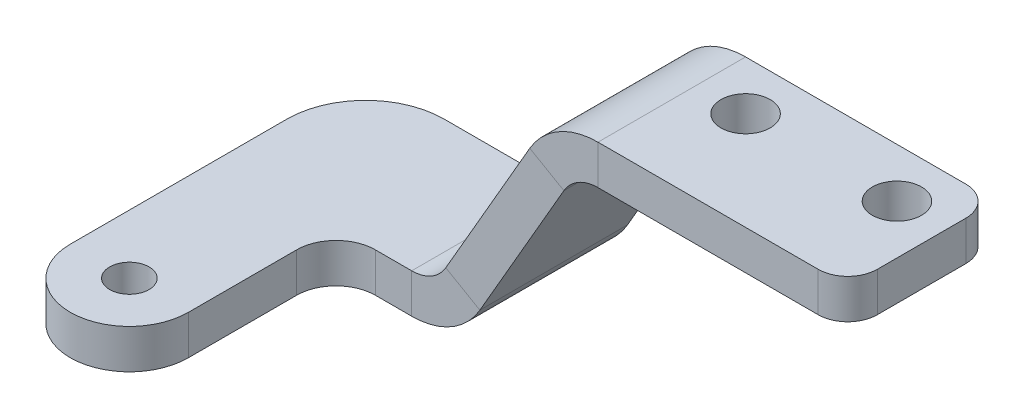
ISO-10303-21;
HEADER;
FILE_DESCRIPTION(('STEP AP214'),'2;1');
FILE_NAME('part.step','',(''),(''),'','','');
FILE_SCHEMA(('AUTOMOTIVE_DESIGN { 1 0 10303 214 1 1 1 1 }'));
ENDSEC;
DATA;
#1=APPLICATION_CONTEXT('core data for automotive mechanical design processes');
#2=APPLICATION_PROTOCOL_DEFINITION('international standard','automotive_design',2000,#1);
#3=PRODUCT_CONTEXT('',#1,'mechanical');
#4=PRODUCT('Part','Part','',(#3));
#5=PRODUCT_RELATED_PRODUCT_CATEGORY('part','',(#4));
#6=PRODUCT_DEFINITION_FORMATION('','',#4);
#7=PRODUCT_DEFINITION_CONTEXT('part definition',#1,'design');
#8=PRODUCT_DEFINITION('design','',#6,#7);
#9=PRODUCT_DEFINITION_SHAPE('','',#8);
#10=(LENGTH_UNIT() NAMED_UNIT(*) SI_UNIT(.MILLI.,.METRE.));
#11=(NAMED_UNIT(*) PLANE_ANGLE_UNIT() SI_UNIT($,.RADIAN.));
#12=(NAMED_UNIT(*) SI_UNIT($,.STERADIAN.) SOLID_ANGLE_UNIT());
#13=UNCERTAINTY_MEASURE_WITH_UNIT(LENGTH_MEASURE(1.E-05),#10,'distance_accuracy_value','');
#14=(GEOMETRIC_REPRESENTATION_CONTEXT(3) GLOBAL_UNCERTAINTY_ASSIGNED_CONTEXT((#13)) GLOBAL_UNIT_ASSIGNED_CONTEXT((#10,
#11,#12)) REPRESENTATION_CONTEXT('',''));
#15=CARTESIAN_POINT('',(0.,0.,0.));
#16=DIRECTION('',(0.,0.,1.));
#17=DIRECTION('',(1.,0.,0.));
#18=AXIS2_PLACEMENT_3D('',#15,#16,#17);
#19=CARTESIAN_POINT('',(30.3094010767586,16.7846096908265,-30.));
#20=DIRECTION('',(0.,0.,1.));
#21=DIRECTION('',(1.,0.,0.));
#22=AXIS2_PLACEMENT_3D('',#19,#20,#21);
#23=PLANE('',#22);
#24=DIRECTION('',(-0.866025403784436,0.500000000000004,0.));
#25=VECTOR('',#24,1.);
#26=CARTESIAN_POINT('',(29.1547005383793,14.7846096908265,-30.));
#27=LINE('',#26,#25);
#28=CARTESIAN_POINT('',(29.1547005383793,14.7846096908265,-30.));
#29=VERTEX_POINT('',#28);
#30=CARTESIAN_POINT('',(25.6905989232416,16.7846096908265,-30.));
#31=VERTEX_POINT('',#30);
#32=EDGE_CURVE('E218',#29,#31,#27,.T.);
#33=ORIENTED_EDGE('',*,*,#32,.F.);
#34=DIRECTION('',(0.500000000000004,0.866025403784437,0.));
#35=VECTOR('',#34,1.);
#36=CARTESIAN_POINT('',(30.3094010767586,16.7846096908265,-30.));
#37=LINE('',#36,#35);
#38=CARTESIAN_POINT('',(20.618802153517,0.,-30.));
#39=VERTEX_POINT('',#38);
#40=EDGE_CURVE('E234',#39,#29,#37,.T.);
#41=ORIENTED_EDGE('',*,*,#40,.F.);
#42=DIRECTION('',(0.866025403784436,-0.500000000000004,0.));
#43=VECTOR('',#42,1.);
#44=CARTESIAN_POINT('',(17.1547005383793,1.99999999999998,-30.));
#45=LINE('',#44,#43);
#46=CARTESIAN_POINT('',(17.1547005383793,1.99999999999999,-30.));
#47=VERTEX_POINT('',#46);
#48=EDGE_CURVE('E225',#47,#39,#45,.T.);
#49=ORIENTED_EDGE('',*,*,#48,.F.);
#50=DIRECTION('',(0.500000000000004,0.866025403784437,0.));
#51=VECTOR('',#50,1.);
#52=CARTESIAN_POINT('',(26.8452994616208,18.7846096908265,-30.));
#53=LINE('',#52,#51);
#54=EDGE_CURVE('E233',#47,#31,#53,.T.);
#55=ORIENTED_EDGE('',*,*,#54,.T.);
#56=EDGE_LOOP('',(#33,#41,#49,#55));
#57=FACE_BOUND('',#56,.T.);
#58=ADVANCED_FACE('F38',(#57),#23,.F.);
#59=CARTESIAN_POINT('',(19.4641016151377,-2.00000000000002,-15.));
#60=DIRECTION('',(0.,0.,-1.));
#61=DIRECTION('',(-1.,0.,0.));
#62=AXIS2_PLACEMENT_3D('',#59,#60,#61);
#63=PLANE('',#62);
#64=DIRECTION('',(-0.866025403784436,0.500000000000004,0.));
#65=VECTOR('',#64,1.);
#66=CARTESIAN_POINT('',(29.1547005383793,14.7846096908265,-15.));
#67=LINE('',#66,#65);
#68=CARTESIAN_POINT('',(29.1547005383793,14.7846096908265,-15.));
#69=VERTEX_POINT('',#68);
#70=CARTESIAN_POINT('',(25.6905989232416,16.7846096908265,-15.));
#71=VERTEX_POINT('',#70);
#72=EDGE_CURVE('E211',#69,#71,#67,.T.);
#73=ORIENTED_EDGE('',*,*,#72,.T.);
#74=DIRECTION('',(-0.500000000000004,-0.866025403784437,0.));
#75=VECTOR('',#74,1.);
#76=CARTESIAN_POINT('',(16.,0.,-15.));
#77=LINE('',#76,#75);
#78=CARTESIAN_POINT('',(17.1547005383792,1.99999999999999,-15.));
#79=VERTEX_POINT('',#78);
#80=EDGE_CURVE('E238',#71,#79,#77,.T.);
#81=ORIENTED_EDGE('',*,*,#80,.T.);
#82=DIRECTION('',(0.866025403784436,-0.500000000000004,0.));
#83=VECTOR('',#82,1.);
#84=CARTESIAN_POINT('',(17.1547005383793,1.99999999999998,-15.));
#85=LINE('',#84,#83);
#86=CARTESIAN_POINT('',(20.618802153517,0.,-15.));
#87=VERTEX_POINT('',#86);
#88=EDGE_CURVE('E221',#79,#87,#85,.T.);
#89=ORIENTED_EDGE('',*,*,#88,.T.);
#90=DIRECTION('',(-0.500000000000004,-0.866025403784437,0.));
#91=VECTOR('',#90,1.);
#92=CARTESIAN_POINT('',(19.4641016151377,-2.00000000000002,-15.));
#93=LINE('',#92,#91);
#94=EDGE_CURVE('E237',#69,#87,#93,.T.);
#95=ORIENTED_EDGE('',*,*,#94,.F.);
#96=EDGE_LOOP('',(#73,#81,#89,#95));
#97=FACE_BOUND('',#96,.T.);
#98=ADVANCED_FACE('F384',(#97),#63,.F.);
#99=CARTESIAN_POINT('',(15.4641016151377,-8.92820323027555,0.));
#100=DIRECTION('',(-0.866025403784437,0.500000000000004,0.));
#101=DIRECTION('',(-0.500000000000004,-0.866025403784437,0.));
#102=AXIS2_PLACEMENT_3D('',#99,#100,#101);
#103=PLANE('',#102);
#104=DIRECTION('',(0.,0.,1.));
#105=VECTOR('',#104,1.);
#106=CARTESIAN_POINT('',(29.1547005383793,14.7846096908265,-15.));
#107=LINE('',#106,#105);
#108=EDGE_CURVE('E215',#69,#29,#107,.F.);
#109=ORIENTED_EDGE('',*,*,#108,.F.);
#110=ORIENTED_EDGE('',*,*,#94,.T.);
#111=DIRECTION('',(0.,0.,1.));
#112=VECTOR('',#111,1.);
#113=CARTESIAN_POINT('',(20.618802153517,0.,0.));
#114=LINE('',#113,#112);
#115=EDGE_CURVE('E228',#39,#87,#114,.T.);
#116=ORIENTED_EDGE('',*,*,#115,.F.);
#117=ORIENTED_EDGE('',*,*,#40,.T.);
#118=EDGE_LOOP('',(#109,#110,#116,#117));
#119=FACE_BOUND('',#118,.T.);
#120=ADVANCED_FACE('F390',(#119),#103,.F.);
#121=CARTESIAN_POINT('',(11.9999999999999,-6.92820323027554,0.));
#122=DIRECTION('',(-0.866025403784437,0.500000000000004,0.));
#123=DIRECTION('',(-0.500000000000004,-0.866025403784437,0.));
#124=AXIS2_PLACEMENT_3D('',#121,#122,#123);
#125=PLANE('',#124);
#126=ORIENTED_EDGE('',*,*,#80,.F.);
#127=DIRECTION('',(0.,0.,1.));
#128=VECTOR('',#127,1.);
#129=CARTESIAN_POINT('',(25.6905989232416,16.7846096908265,-15.));
#130=LINE('',#129,#128);
#131=EDGE_CURVE('E183',#71,#31,#130,.F.);
#132=ORIENTED_EDGE('',*,*,#131,.T.);
#133=ORIENTED_EDGE('',*,*,#54,.F.);
#134=DIRECTION('',(0.,0.,-1.));
#135=VECTOR('',#134,1.);
#136=CARTESIAN_POINT('',(17.1547005383793,1.99999999999998,-15.));
#137=LINE('',#136,#135);
#138=EDGE_CURVE('E223',#79,#47,#137,.T.);
#139=ORIENTED_EDGE('',*,*,#138,.F.);
#140=EDGE_LOOP('',(#126,#132,#133,#139));
#141=FACE_BOUND('',#140,.T.);
#142=ADVANCED_FACE('F430',(#141),#125,.T.);
#143=CARTESIAN_POINT('',(2.,-4.,-30.));
#144=DIRECTION('',(0.,0.,-1.));
#145=DIRECTION('',(-1.,0.,0.));
#146=AXIS2_PLACEMENT_3D('',#143,#144,#145);
#147=PLANE('',#146);
#148=DIRECTION('',(-1.,0.,0.));
#149=VECTOR('',#148,1.);
#150=CARTESIAN_POINT('',(2.,0.,-30.));
#151=LINE('',#150,#149);
#152=CARTESIAN_POINT('',(13.6905989232415,0.,-30.));
#153=VERTEX_POINT('',#152);
#154=CARTESIAN_POINT('',(2.,0.,-30.));
#155=VERTEX_POINT('',#154);
#156=EDGE_CURVE('E277',#153,#155,#151,.T.);
#157=ORIENTED_EDGE('',*,*,#156,.F.);
#158=DIRECTION('',(0.,-1.,0.));
#159=VECTOR('',#158,1.);
#160=CARTESIAN_POINT('',(13.6905989232415,0.,-30.));
#161=LINE('',#160,#159);
#162=CARTESIAN_POINT('',(13.6905989232415,-4.,-30.));
#163=VERTEX_POINT('',#162);
#164=EDGE_CURVE('E250',#153,#163,#161,.T.);
#165=ORIENTED_EDGE('',*,*,#164,.T.);
#166=DIRECTION('',(-1.,0.,0.));
#167=VECTOR('',#166,1.);
#168=CARTESIAN_POINT('',(2.,-4.,-30.));
#169=LINE('',#168,#167);
#170=CARTESIAN_POINT('',(2.,-4.,-30.));
#171=VERTEX_POINT('',#170);
#172=EDGE_CURVE('E292',#163,#171,#169,.T.);
#173=ORIENTED_EDGE('',*,*,#172,.T.);
#174=DIRECTION('',(0.,1.,0.));
#175=VECTOR('',#174,1.);
#176=CARTESIAN_POINT('',(2.,-4.,-30.));
#177=LINE('',#176,#175);
#178=EDGE_CURVE('E313',#171,#155,#177,.T.);
#179=ORIENTED_EDGE('',*,*,#178,.T.);
#180=EDGE_LOOP('',(#157,#165,#173,#179));
#181=FACE_BOUND('',#180,.T.);
#182=ADVANCED_FACE('F422',(#181),#147,.T.);
#183=CARTESIAN_POINT('',(2.,-4.,-22.));
#184=DIRECTION('',(0.,1.,0.));
#185=DIRECTION('',(0.,0.,1.));
#186=AXIS2_PLACEMENT_3D('',#183,#184,#185);
#187=PLANE('',#186);
#188=CARTESIAN_POINT('',(0.,-4.,0.));
#189=DIRECTION('',(0.,1.,0.));
#190=DIRECTION('',(0.,0.,1.));
#191=AXIS2_PLACEMENT_3D('',#188,#189,#190);
#192=CIRCLE('',#191,2.);
#193=CARTESIAN_POINT('',(0.,-4.,2.));
#194=VERTEX_POINT('',#193);
#195=EDGE_CURVE('E267',#194,#194,#192,.T.);
#196=ORIENTED_EDGE('',*,*,#195,.T.);
#197=EDGE_LOOP('',(#196));
#198=FACE_BOUND('',#197,.T.);
#199=DIRECTION('',(0.,0.,-1.));
#200=VECTOR('',#199,1.);
#201=CARTESIAN_POINT('',(13.6905989232415,-4.,-30.));
#202=LINE('',#201,#200);
#203=CARTESIAN_POINT('',(13.6905989232415,-4.,-15.));
#204=VERTEX_POINT('',#203);
#205=EDGE_CURVE('E244',#163,#204,#202,.F.);
#206=ORIENTED_EDGE('',*,*,#205,.T.);
#207=DIRECTION('',(1.,0.,0.));
#208=VECTOR('',#207,1.);
#209=CARTESIAN_POINT('',(16.,-4.,-15.));
#210=LINE('',#209,#208);
#211=CARTESIAN_POINT('',(10.,-4.,-15.));
#212=VERTEX_POINT('',#211);
#213=EDGE_CURVE('E289',#212,#204,#210,.T.);
#214=ORIENTED_EDGE('',*,*,#213,.F.);
#215=CARTESIAN_POINT('',(10.,-4.,-11.));
#216=DIRECTION('',(0.,-1.,0.));
#217=DIRECTION('',(0.,0.,1.));
#218=AXIS2_PLACEMENT_3D('',#215,#216,#217);
#219=CIRCLE('',#218,4.);
#220=CARTESIAN_POINT('',(6.,-4.,-11.));
#221=VERTEX_POINT('',#220);
#222=EDGE_CURVE('E286',#221,#212,#219,.T.);
#223=ORIENTED_EDGE('',*,*,#222,.F.);
#224=DIRECTION('',(0.,0.,-1.));
#225=VECTOR('',#224,1.);
#226=CARTESIAN_POINT('',(6.,-4.,-11.));
#227=LINE('',#226,#225);
#228=CARTESIAN_POINT('',(6.,-4.,0.));
#229=VERTEX_POINT('',#228);
#230=EDGE_CURVE('E283',#229,#221,#227,.T.);
#231=ORIENTED_EDGE('',*,*,#230,.F.);
#232=CARTESIAN_POINT('',(0.,-4.,0.));
#233=DIRECTION('',(0.,1.,0.));
#234=DIRECTION('',(0.,0.,1.));
#235=AXIS2_PLACEMENT_3D('',#232,#233,#234);
#236=CIRCLE('',#235,6.);
#237=CARTESIAN_POINT('',(-6.,-4.,0.));
#238=VERTEX_POINT('',#237);
#239=EDGE_CURVE('E280',#238,#229,#236,.T.);
#240=ORIENTED_EDGE('',*,*,#239,.F.);
#241=DIRECTION('',(0.,0.,1.));
#242=VECTOR('',#241,1.);
#243=CARTESIAN_POINT('',(-6.,-4.,0.));
#244=LINE('',#243,#242);
#245=CARTESIAN_POINT('',(-6.,-4.,-22.));
#246=VERTEX_POINT('',#245);
#247=EDGE_CURVE('E276',#246,#238,#244,.T.);
#248=ORIENTED_EDGE('',*,*,#247,.F.);
#249=CARTESIAN_POINT('',(2.,-4.,-22.));
#250=DIRECTION('',(0.,1.,0.));
#251=DIRECTION('',(0.,0.,1.));
#252=AXIS2_PLACEMENT_3D('',#249,#250,#251);
#253=CIRCLE('',#252,8.);
#254=EDGE_CURVE('E273',#171,#246,#253,.T.);
#255=ORIENTED_EDGE('',*,*,#254,.F.);
#256=ORIENTED_EDGE('',*,*,#172,.F.);
#257=EDGE_LOOP('',(#206,#214,#223,#231,#240,#248,#255,#256));
#258=FACE_BOUND('',#257,.T.);
#259=ADVANCED_FACE('F418',(#198,#258),#187,.F.);
#260=CARTESIAN_POINT('',(2.,0.,-22.));
#261=DIRECTION('',(0.,1.,0.));
#262=DIRECTION('',(0.,0.,1.));
#263=AXIS2_PLACEMENT_3D('',#260,#261,#262);
#264=PLANE('',#263);
#265=CARTESIAN_POINT('',(0.,0.,0.));
#266=DIRECTION('',(0.,1.,0.));
#267=DIRECTION('',(0.,0.,1.));
#268=AXIS2_PLACEMENT_3D('',#265,#266,#267);
#269=CIRCLE('',#268,2.);
#270=CARTESIAN_POINT('',(0.,0.,2.));
#271=VERTEX_POINT('',#270);
#272=EDGE_CURVE('E264',#271,#271,#269,.T.);
#273=ORIENTED_EDGE('',*,*,#272,.F.);
#274=EDGE_LOOP('',(#273));
#275=FACE_BOUND('',#274,.T.);
#276=DIRECTION('',(1.,0.,0.));
#277=VECTOR('',#276,1.);
#278=CARTESIAN_POINT('',(16.,0.,-15.));
#279=LINE('',#278,#277);
#280=CARTESIAN_POINT('',(10.,0.,-15.));
#281=VERTEX_POINT('',#280);
#282=CARTESIAN_POINT('',(13.6905989232415,0.,-15.));
#283=VERTEX_POINT('',#282);
#284=EDGE_CURVE('E309',#281,#283,#279,.T.);
#285=ORIENTED_EDGE('',*,*,#284,.T.);
#286=DIRECTION('',(0.,0.,-1.));
#287=VECTOR('',#286,1.);
#288=CARTESIAN_POINT('',(13.6905989232415,0.,-30.));
#289=LINE('',#288,#287);
#290=EDGE_CURVE('E256',#153,#283,#289,.F.);
#291=ORIENTED_EDGE('',*,*,#290,.F.);
#292=ORIENTED_EDGE('',*,*,#156,.T.);
#293=CARTESIAN_POINT('',(2.,0.,-22.));
#294=DIRECTION('',(0.,1.,0.));
#295=DIRECTION('',(0.,0.,1.));
#296=AXIS2_PLACEMENT_3D('',#293,#294,#295);
#297=CIRCLE('',#296,8.);
#298=CARTESIAN_POINT('',(-6.,0.,-22.));
#299=VERTEX_POINT('',#298);
#300=EDGE_CURVE('E270',#155,#299,#297,.T.);
#301=ORIENTED_EDGE('',*,*,#300,.T.);
#302=DIRECTION('',(0.,0.,1.));
#303=VECTOR('',#302,1.);
#304=CARTESIAN_POINT('',(-6.,0.,0.));
#305=LINE('',#304,#303);
#306=CARTESIAN_POINT('',(-6.,0.,0.));
#307=VERTEX_POINT('',#306);
#308=EDGE_CURVE('E297',#299,#307,#305,.T.);
#309=ORIENTED_EDGE('',*,*,#308,.T.);
#310=CARTESIAN_POINT('',(0.,0.,0.));
#311=DIRECTION('',(0.,1.,0.));
#312=DIRECTION('',(0.,0.,1.));
#313=AXIS2_PLACEMENT_3D('',#310,#311,#312);
#314=CIRCLE('',#313,6.);
#315=CARTESIAN_POINT('',(6.,0.,0.));
#316=VERTEX_POINT('',#315);
#317=EDGE_CURVE('E300',#307,#316,#314,.T.);
#318=ORIENTED_EDGE('',*,*,#317,.T.);
#319=DIRECTION('',(0.,0.,-1.));
#320=VECTOR('',#319,1.);
#321=CARTESIAN_POINT('',(6.,0.,-11.));
#322=LINE('',#321,#320);
#323=CARTESIAN_POINT('',(6.,0.,-11.));
#324=VERTEX_POINT('',#323);
#325=EDGE_CURVE('E303',#316,#324,#322,.T.);
#326=ORIENTED_EDGE('',*,*,#325,.T.);
#327=CARTESIAN_POINT('',(10.,0.,-11.));
#328=DIRECTION('',(0.,-1.,0.));
#329=DIRECTION('',(0.,0.,1.));
#330=AXIS2_PLACEMENT_3D('',#327,#328,#329);
#331=CIRCLE('',#330,4.);
#332=EDGE_CURVE('E306',#324,#281,#331,.T.);
#333=ORIENTED_EDGE('',*,*,#332,.T.);
#334=EDGE_LOOP('',(#285,#291,#292,#301,#309,#318,#326,#333));
#335=FACE_BOUND('',#334,.T.);
#336=ADVANCED_FACE('F421',(#275,#335),#264,.T.);
#337=CARTESIAN_POINT('',(2.,-4.,-22.));
#338=DIRECTION('',(0.,1.,0.));
#339=DIRECTION('',(0.,0.,1.));
#340=AXIS2_PLACEMENT_3D('',#337,#338,#339);
#341=CYLINDRICAL_SURFACE('',#340,8.);
#342=ORIENTED_EDGE('',*,*,#300,.F.);
#343=ORIENTED_EDGE('',*,*,#178,.F.);
#344=ORIENTED_EDGE('',*,*,#254,.T.);
#345=DIRECTION('',(0.,1.,0.));
#346=VECTOR('',#345,1.);
#347=CARTESIAN_POINT('',(-6.,-4.,-22.));
#348=LINE('',#347,#346);
#349=EDGE_CURVE('E294',#246,#299,#348,.T.);
#350=ORIENTED_EDGE('',*,*,#349,.T.);
#351=EDGE_LOOP('',(#342,#343,#344,#350));
#352=FACE_BOUND('',#351,.T.);
#353=ADVANCED_FACE('F426',(#352),#341,.T.);
#354=CARTESIAN_POINT('',(16.,-4.,-15.));
#355=DIRECTION('',(0.,0.,1.));
#356=DIRECTION('',(1.,0.,0.));
#357=AXIS2_PLACEMENT_3D('',#354,#355,#356);
#358=PLANE('',#357);
#359=DIRECTION('',(0.,-1.,0.));
#360=VECTOR('',#359,1.);
#361=CARTESIAN_POINT('',(13.6905989232415,0.,-15.));
#362=LINE('',#361,#360);
#363=EDGE_CURVE('E261',#283,#204,#362,.T.);
#364=ORIENTED_EDGE('',*,*,#363,.F.);
#365=ORIENTED_EDGE('',*,*,#284,.F.);
#366=DIRECTION('',(0.,1.,0.));
#367=VECTOR('',#366,1.);
#368=CARTESIAN_POINT('',(10.,-4.,-15.));
#369=LINE('',#368,#367);
#370=EDGE_CURVE('E317',#212,#281,#369,.T.);
#371=ORIENTED_EDGE('',*,*,#370,.F.);
#372=ORIENTED_EDGE('',*,*,#213,.T.);
#373=EDGE_LOOP('',(#364,#365,#371,#372));
#374=FACE_BOUND('',#373,.T.);
#375=ADVANCED_FACE('F432',(#374),#358,.T.);
#376=CARTESIAN_POINT('',(10.,-4.,-11.));
#377=DIRECTION('',(0.,1.,0.));
#378=DIRECTION('',(0.,0.,1.));
#379=AXIS2_PLACEMENT_3D('',#376,#377,#378);
#380=CYLINDRICAL_SURFACE('',#379,4.);
#381=ORIENTED_EDGE('',*,*,#332,.F.);
#382=DIRECTION('',(0.,1.,0.));
#383=VECTOR('',#382,1.);
#384=CARTESIAN_POINT('',(6.,-4.,-11.));
#385=LINE('',#384,#383);
#386=EDGE_CURVE('E319',#221,#324,#385,.T.);
#387=ORIENTED_EDGE('',*,*,#386,.F.);
#388=ORIENTED_EDGE('',*,*,#222,.T.);
#389=ORIENTED_EDGE('',*,*,#370,.T.);
#390=EDGE_LOOP('',(#381,#387,#388,#389));
#391=FACE_BOUND('',#390,.T.);
#392=ADVANCED_FACE('F435',(#391),#380,.F.);
#393=CARTESIAN_POINT('',(6.,-4.,-11.));
#394=DIRECTION('',(1.,0.,0.));
#395=DIRECTION('',(0.,0.,-1.));
#396=AXIS2_PLACEMENT_3D('',#393,#394,#395);
#397=PLANE('',#396);
#398=ORIENTED_EDGE('',*,*,#325,.F.);
#399=DIRECTION('',(0.,1.,0.));
#400=VECTOR('',#399,1.);
#401=CARTESIAN_POINT('',(6.,-4.,0.));
#402=LINE('',#401,#400);
#403=EDGE_CURVE('E321',#229,#316,#402,.T.);
#404=ORIENTED_EDGE('',*,*,#403,.F.);
#405=ORIENTED_EDGE('',*,*,#230,.T.);
#406=ORIENTED_EDGE('',*,*,#386,.T.);
#407=EDGE_LOOP('',(#398,#404,#405,#406));
#408=FACE_BOUND('',#407,.T.);
#409=ADVANCED_FACE('F439',(#408),#397,.T.);
#410=CARTESIAN_POINT('',(0.,-4.,0.));
#411=DIRECTION('',(0.,1.,0.));
#412=DIRECTION('',(0.,0.,1.));
#413=AXIS2_PLACEMENT_3D('',#410,#411,#412);
#414=CYLINDRICAL_SURFACE('',#413,6.);
#415=ORIENTED_EDGE('',*,*,#317,.F.);
#416=DIRECTION('',(0.,1.,0.));
#417=VECTOR('',#416,1.);
#418=CARTESIAN_POINT('',(-6.,-4.,0.));
#419=LINE('',#418,#417);
#420=EDGE_CURVE('E323',#238,#307,#419,.T.);
#421=ORIENTED_EDGE('',*,*,#420,.F.);
#422=ORIENTED_EDGE('',*,*,#239,.T.);
#423=ORIENTED_EDGE('',*,*,#403,.T.);
#424=EDGE_LOOP('',(#415,#421,#422,#423));
#425=FACE_BOUND('',#424,.T.);
#426=ADVANCED_FACE('F443',(#425),#414,.T.);
#427=CARTESIAN_POINT('',(-6.,-4.,0.));
#428=DIRECTION('',(-1.,0.,0.));
#429=DIRECTION('',(0.,0.,1.));
#430=AXIS2_PLACEMENT_3D('',#427,#428,#429);
#431=PLANE('',#430);
#432=ORIENTED_EDGE('',*,*,#308,.F.);
#433=ORIENTED_EDGE('',*,*,#349,.F.);
#434=ORIENTED_EDGE('',*,*,#247,.T.);
#435=ORIENTED_EDGE('',*,*,#420,.T.);
#436=EDGE_LOOP('',(#432,#433,#434,#435));
#437=FACE_BOUND('',#436,.T.);
#438=ADVANCED_FACE('F416',(#437),#431,.T.);
#439=CARTESIAN_POINT('',(0.,-4.,0.));
#440=DIRECTION('',(0.,1.,0.));
#441=DIRECTION('',(0.,0.,1.));
#442=AXIS2_PLACEMENT_3D('',#439,#440,#441);
#443=CYLINDRICAL_SURFACE('',#442,2.);
#444=ORIENTED_EDGE('',*,*,#195,.F.);
#445=EDGE_LOOP('',(#444));
#446=FACE_BOUND('',#445,.T.);
#447=ORIENTED_EDGE('',*,*,#272,.T.);
#448=EDGE_LOOP('',(#447));
#449=FACE_BOUND('',#448,.T.);
#450=ADVANCED_FACE('F409',(#446,#449),#443,.F.);
#451=CARTESIAN_POINT('',(13.6905989232415,4.,-15.));
#452=DIRECTION('',(0.,0.,1.));
#453=DIRECTION('',(1.,0.,0.));
#454=AXIS2_PLACEMENT_3D('',#451,#452,#453);
#455=PLANE('',#454);
#456=ORIENTED_EDGE('',*,*,#88,.F.);
#457=CARTESIAN_POINT('',(13.6905989232415,4.,-15.));
#458=DIRECTION('',(0.,0.,-1.));
#459=DIRECTION('',(-1.,0.,0.));
#460=AXIS2_PLACEMENT_3D('',#457,#458,#459);
#461=CIRCLE('',#460,4.);
#462=EDGE_CURVE('E253',#283,#79,#461,.F.);
#463=ORIENTED_EDGE('',*,*,#462,.F.);
#464=ORIENTED_EDGE('',*,*,#363,.T.);
#465=CARTESIAN_POINT('',(13.6905989232415,4.,-15.));
#466=DIRECTION('',(0.,0.,-1.));
#467=DIRECTION('',(-1.,0.,0.));
#468=AXIS2_PLACEMENT_3D('',#465,#466,#467);
#469=CIRCLE('',#468,8.);
#470=EDGE_CURVE('E246',#204,#87,#469,.F.);
#471=ORIENTED_EDGE('',*,*,#470,.T.);
#472=EDGE_LOOP('',(#456,#463,#464,#471));
#473=FACE_BOUND('',#472,.T.);
#474=ADVANCED_FACE('F406',(#473),#455,.T.);
#475=CARTESIAN_POINT('',(13.6905989232415,4.,-30.));
#476=DIRECTION('',(0.,0.,1.));
#477=DIRECTION('',(1.,0.,0.));
#478=AXIS2_PLACEMENT_3D('',#475,#476,#477);
#479=PLANE('',#478);
#480=CARTESIAN_POINT('',(13.6905989232415,4.,-30.));
#481=DIRECTION('',(0.,0.,-1.));
#482=DIRECTION('',(-1.,0.,0.));
#483=AXIS2_PLACEMENT_3D('',#480,#481,#482);
#484=CIRCLE('',#483,4.);
#485=EDGE_CURVE('E240',#47,#153,#484,.T.);
#486=ORIENTED_EDGE('',*,*,#485,.F.);
#487=ORIENTED_EDGE('',*,*,#48,.T.);
#488=CARTESIAN_POINT('',(13.6905989232415,4.,-30.));
#489=DIRECTION('',(0.,0.,-1.));
#490=DIRECTION('',(-1.,0.,0.));
#491=AXIS2_PLACEMENT_3D('',#488,#489,#490);
#492=CIRCLE('',#491,8.);
#493=EDGE_CURVE('E247',#39,#163,#492,.T.);
#494=ORIENTED_EDGE('',*,*,#493,.T.);
#495=ORIENTED_EDGE('',*,*,#164,.F.);
#496=EDGE_LOOP('',(#486,#487,#494,#495));
#497=FACE_BOUND('',#496,.T.);
#498=ADVANCED_FACE('F400',(#497),#479,.F.);
#499=CARTESIAN_POINT('',(13.6905989232415,4.,-30.));
#500=DIRECTION('',(0.,0.,-1.));
#501=DIRECTION('',(0.866025403784437,-0.500000000000004,0.));
#502=AXIS2_PLACEMENT_3D('',#499,#500,#501);
#503=CYLINDRICAL_SURFACE('',#502,8.);
#504=ORIENTED_EDGE('',*,*,#205,.F.);
#505=ORIENTED_EDGE('',*,*,#493,.F.);
#506=ORIENTED_EDGE('',*,*,#115,.T.);
#507=ORIENTED_EDGE('',*,*,#470,.F.);
#508=EDGE_LOOP('',(#504,#505,#506,#507));
#509=FACE_BOUND('',#508,.T.);
#510=ADVANCED_FACE('F396',(#509),#503,.T.);
#511=CARTESIAN_POINT('',(13.6905989232415,4.,-30.));
#512=DIRECTION('',(0.,0.,-1.));
#513=DIRECTION('',(0.866025403784437,-0.500000000000004,0.));
#514=AXIS2_PLACEMENT_3D('',#511,#512,#513);
#515=CYLINDRICAL_SURFACE('',#514,4.);
#516=ORIENTED_EDGE('',*,*,#290,.T.);
#517=ORIENTED_EDGE('',*,*,#462,.T.);
#518=ORIENTED_EDGE('',*,*,#138,.T.);
#519=ORIENTED_EDGE('',*,*,#485,.T.);
#520=EDGE_LOOP('',(#516,#517,#518,#519));
#521=FACE_BOUND('',#520,.T.);
#522=ADVANCED_FACE('F399',(#521),#515,.F.);
#523=CARTESIAN_POINT('',(32.6188021535171,12.7846096908265,-30.));
#524=DIRECTION('',(0.,0.,-1.));
#525=DIRECTION('',(-1.,0.,0.));
#526=AXIS2_PLACEMENT_3D('',#523,#524,#525);
#527=PLANE('',#526);
#528=DIRECTION('',(0.,1.,0.));
#529=VECTOR('',#528,1.);
#530=CARTESIAN_POINT('',(32.6188021535171,16.7846096908265,-30.));
#531=LINE('',#530,#529);
#532=CARTESIAN_POINT('',(32.6188021535171,16.7846096908265,-30.));
#533=VERTEX_POINT('',#532);
#534=CARTESIAN_POINT('',(32.6188021535171,20.7846096908265,-30.));
#535=VERTEX_POINT('',#534);
#536=EDGE_CURVE('E203',#533,#535,#531,.T.);
#537=ORIENTED_EDGE('',*,*,#536,.F.);
#538=CARTESIAN_POINT('',(32.6188021535171,12.7846096908265,-30.));
#539=DIRECTION('',(0.,0.,1.));
#540=DIRECTION('',(1.,0.,0.));
#541=AXIS2_PLACEMENT_3D('',#538,#539,#540);
#542=CIRCLE('',#541,4.00000000000001);
#543=EDGE_CURVE('E186',#29,#533,#542,.F.);
#544=ORIENTED_EDGE('',*,*,#543,.F.);
#545=ORIENTED_EDGE('',*,*,#32,.T.);
#546=CARTESIAN_POINT('',(32.6188021535171,12.7846096908265,-30.));
#547=DIRECTION('',(0.,0.,1.));
#548=DIRECTION('',(1.,0.,0.));
#549=AXIS2_PLACEMENT_3D('',#546,#547,#548);
#550=CIRCLE('',#549,8.00000000000001);
#551=EDGE_CURVE('E210',#31,#535,#550,.F.);
#552=ORIENTED_EDGE('',*,*,#551,.T.);
#553=EDGE_LOOP('',(#537,#544,#545,#552));
#554=FACE_BOUND('',#553,.T.);
#555=ADVANCED_FACE('F404',(#554),#527,.T.);
#556=CARTESIAN_POINT('',(32.6188021535171,12.7846096908265,-15.));
#557=DIRECTION('',(0.,0.,-1.));
#558=DIRECTION('',(-1.,0.,0.));
#559=AXIS2_PLACEMENT_3D('',#556,#557,#558);
#560=PLANE('',#559);
#561=CARTESIAN_POINT('',(32.6188021535171,12.7846096908265,-15.));
#562=DIRECTION('',(0.,0.,1.));
#563=DIRECTION('',(1.,0.,0.));
#564=AXIS2_PLACEMENT_3D('',#561,#562,#563);
#565=CIRCLE('',#564,4.00000000000001);
#566=CARTESIAN_POINT('',(32.6188021535171,16.7846096908265,-15.));
#567=VERTEX_POINT('',#566);
#568=EDGE_CURVE('E173',#567,#69,#565,.T.);
#569=ORIENTED_EDGE('',*,*,#568,.F.);
#570=DIRECTION('',(0.,1.,0.));
#571=VECTOR('',#570,1.);
#572=CARTESIAN_POINT('',(32.6188021535171,16.7846096908265,-15.));
#573=LINE('',#572,#571);
#574=CARTESIAN_POINT('',(32.6188021535171,20.7846096908265,-15.));
#575=VERTEX_POINT('',#574);
#576=EDGE_CURVE('E166',#567,#575,#573,.T.);
#577=ORIENTED_EDGE('',*,*,#576,.T.);
#578=CARTESIAN_POINT('',(32.6188021535171,12.7846096908265,-15.));
#579=DIRECTION('',(0.,0.,1.));
#580=DIRECTION('',(1.,0.,0.));
#581=AXIS2_PLACEMENT_3D('',#578,#579,#580);
#582=CIRCLE('',#581,8.00000000000001);
#583=EDGE_CURVE('E178',#575,#71,#582,.T.);
#584=ORIENTED_EDGE('',*,*,#583,.T.);
#585=ORIENTED_EDGE('',*,*,#72,.F.);
#586=EDGE_LOOP('',(#569,#577,#584,#585));
#587=FACE_BOUND('',#586,.T.);
#588=ADVANCED_FACE('F189',(#587),#560,.F.);
#589=CARTESIAN_POINT('',(32.6188021535171,12.7846096908265,-15.));
#590=DIRECTION('',(0.,0.,1.));
#591=DIRECTION('',(0.,1.,0.));
#592=AXIS2_PLACEMENT_3D('',#589,#590,#591);
#593=CYLINDRICAL_SURFACE('',#592,8.00000000000001);
#594=ORIENTED_EDGE('',*,*,#131,.F.);
#595=ORIENTED_EDGE('',*,*,#583,.F.);
#596=DIRECTION('',(0.,0.,1.));
#597=VECTOR('',#596,1.);
#598=CARTESIAN_POINT('',(32.6188021535171,20.7846096908265,0.));
#599=LINE('',#598,#597);
#600=EDGE_CURVE('E180',#535,#575,#599,.T.);
#601=ORIENTED_EDGE('',*,*,#600,.F.);
#602=ORIENTED_EDGE('',*,*,#551,.F.);
#603=EDGE_LOOP('',(#594,#595,#601,#602));
#604=FACE_BOUND('',#603,.T.);
#605=ADVANCED_FACE('F179',(#604),#593,.T.);
#606=CARTESIAN_POINT('',(32.6188021535171,12.7846096908265,-15.));
#607=DIRECTION('',(0.,0.,1.));
#608=DIRECTION('',(0.,1.,0.));
#609=AXIS2_PLACEMENT_3D('',#606,#607,#608);
#610=CYLINDRICAL_SURFACE('',#609,4.00000000000001);
#611=ORIENTED_EDGE('',*,*,#108,.T.);
#612=ORIENTED_EDGE('',*,*,#543,.T.);
#613=DIRECTION('',(0.,0.,1.));
#614=VECTOR('',#613,1.);
#615=CARTESIAN_POINT('',(32.6188021535171,16.7846096908265,-30.));
#616=LINE('',#615,#614);
#617=EDGE_CURVE('E191',#533,#567,#616,.T.);
#618=ORIENTED_EDGE('',*,*,#617,.T.);
#619=ORIENTED_EDGE('',*,*,#568,.T.);
#620=EDGE_LOOP('',(#611,#612,#618,#619));
#621=FACE_BOUND('',#620,.T.);
#622=ADVANCED_FACE('F469',(#621),#610,.F.);
#623=CARTESIAN_POINT('',(30.3094010767586,20.7846096908265,-15.));
#624=DIRECTION('',(0.,0.,1.));
#625=DIRECTION('',(1.,0.,0.));
#626=AXIS2_PLACEMENT_3D('',#623,#624,#625);
#627=PLANE('',#626);
#628=DIRECTION('',(-1.,0.,0.));
#629=VECTOR('',#628,1.);
#630=CARTESIAN_POINT('',(30.3094010767586,16.7846096908265,-15.));
#631=LINE('',#630,#629);
#632=CARTESIAN_POINT('',(55.0000000000001,16.7846096908265,-15.));
#633=VERTEX_POINT('',#632);
#634=EDGE_CURVE('E205',#633,#567,#631,.T.);
#635=ORIENTED_EDGE('',*,*,#634,.F.);
#636=DIRECTION('',(0.,-1.,0.));
#637=VECTOR('',#636,1.);
#638=CARTESIAN_POINT('',(55.0000000000001,20.7846096908265,-15.));
#639=LINE('',#638,#637);
#640=CARTESIAN_POINT('',(55.0000000000001,20.7846096908265,-15.));
#641=VERTEX_POINT('',#640);
#642=EDGE_CURVE('E168',#633,#641,#639,.F.);
#643=ORIENTED_EDGE('',*,*,#642,.T.);
#644=DIRECTION('',(-1.,0.,0.));
#645=VECTOR('',#644,1.);
#646=CARTESIAN_POINT('',(30.3094010767586,20.7846096908265,-15.));
#647=LINE('',#646,#645);
#648=EDGE_CURVE('E161',#641,#575,#647,.T.);
#649=ORIENTED_EDGE('',*,*,#648,.T.);
#650=ORIENTED_EDGE('',*,*,#576,.F.);
#651=EDGE_LOOP('',(#635,#643,#649,#650));
#652=FACE_BOUND('',#651,.T.);
#653=ADVANCED_FACE('F164',(#652),#627,.T.);
#654=CARTESIAN_POINT('',(58.0000000000001,20.7846096908265,-30.));
#655=DIRECTION('',(0.,0.,-1.));
#656=DIRECTION('',(-1.,0.,0.));
#657=AXIS2_PLACEMENT_3D('',#654,#655,#656);
#658=PLANE('',#657);
#659=DIRECTION('',(1.,0.,0.));
#660=VECTOR('',#659,1.);
#661=CARTESIAN_POINT('',(58.0000000000001,20.7846096908265,-30.));
#662=LINE('',#661,#660);
#663=CARTESIAN_POINT('',(55.0000000000001,20.7846096908265,-30.));
#664=VERTEX_POINT('',#663);
#665=EDGE_CURVE('E196',#535,#664,#662,.T.);
#666=ORIENTED_EDGE('',*,*,#665,.T.);
#667=DIRECTION('',(0.,-1.,0.));
#668=VECTOR('',#667,1.);
#669=CARTESIAN_POINT('',(55.0000000000001,20.7846096908265,-30.));
#670=LINE('',#669,#668);
#671=CARTESIAN_POINT('',(55.0000000000001,16.7846096908265,-30.));
#672=VERTEX_POINT('',#671);
#673=EDGE_CURVE('E333',#664,#672,#670,.T.);
#674=ORIENTED_EDGE('',*,*,#673,.T.);
#675=DIRECTION('',(1.,0.,0.));
#676=VECTOR('',#675,1.);
#677=CARTESIAN_POINT('',(58.0000000000001,16.7846096908265,-30.));
#678=LINE('',#677,#676);
#679=EDGE_CURVE('E197',#533,#672,#678,.T.);
#680=ORIENTED_EDGE('',*,*,#679,.F.);
#681=ORIENTED_EDGE('',*,*,#536,.T.);
#682=EDGE_LOOP('',(#666,#674,#680,#681));
#683=FACE_BOUND('',#682,.T.);
#684=ADVANCED_FACE('F339',(#683),#658,.T.);
#685=CARTESIAN_POINT('',(0.,20.7846096908265,0.));
#686=DIRECTION('',(0.,1.,0.));
#687=DIRECTION('',(0.,0.,1.));
#688=AXIS2_PLACEMENT_3D('',#685,#686,#687);
#689=PLANE('',#688);
#690=CARTESIAN_POINT('',(53.0000000000001,20.7846096908265,-25.));
#691=DIRECTION('',(0.,1.,0.));
#692=DIRECTION('',(0.,0.,1.));
#693=AXIS2_PLACEMENT_3D('',#690,#691,#692);
#694=CIRCLE('',#693,2.49999999999999);
#695=CARTESIAN_POINT('',(53.0000000000001,20.7846096908265,-22.5));
#696=VERTEX_POINT('',#695);
#697=EDGE_CURVE('E348',#696,#696,#694,.F.);
#698=ORIENTED_EDGE('',*,*,#697,.T.);
#699=EDGE_LOOP('',(#698));
#700=FACE_BOUND('',#699,.T.);
#701=CARTESIAN_POINT('',(37.6188021535171,20.7846096908265,-25.));
#702=DIRECTION('',(0.,1.,0.));
#703=DIRECTION('',(0.,0.,1.));
#704=AXIS2_PLACEMENT_3D('',#701,#702,#703);
#705=CIRCLE('',#704,2.5);
#706=CARTESIAN_POINT('',(37.6188021535171,20.7846096908265,-22.5));
#707=VERTEX_POINT('',#706);
#708=EDGE_CURVE('E352',#707,#707,#705,.F.);
#709=ORIENTED_EDGE('',*,*,#708,.T.);
#710=EDGE_LOOP('',(#709));
#711=FACE_BOUND('',#710,.T.);
#712=DIRECTION('',(0.,0.,1.));
#713=VECTOR('',#712,1.);
#714=CARTESIAN_POINT('',(58.0000000000001,20.7846096908265,-15.));
#715=LINE('',#714,#713);
#716=CARTESIAN_POINT('',(58.0000000000001,20.7846096908265,-27.));
#717=VERTEX_POINT('',#716);
#718=CARTESIAN_POINT('',(58.0000000000001,20.7846096908265,-18.));
#719=VERTEX_POINT('',#718);
#720=EDGE_CURVE('E174',#717,#719,#715,.T.);
#721=ORIENTED_EDGE('',*,*,#720,.F.);
#722=CARTESIAN_POINT('',(55.0000000000001,20.7846096908265,-27.));
#723=DIRECTION('',(0.,1.,0.));
#724=DIRECTION('',(0.,0.,1.));
#725=AXIS2_PLACEMENT_3D('',#722,#723,#724);
#726=CIRCLE('',#725,3.);
#727=EDGE_CURVE('E11',#717,#664,#726,.T.);
#728=ORIENTED_EDGE('',*,*,#727,.T.);
#729=ORIENTED_EDGE('',*,*,#665,.F.);
#730=ORIENTED_EDGE('',*,*,#600,.T.);
#731=ORIENTED_EDGE('',*,*,#648,.F.);
#732=CARTESIAN_POINT('',(55.0000000000001,20.7846096908265,-18.));
#733=DIRECTION('',(0.,1.,0.));
#734=DIRECTION('',(0.,0.,1.));
#735=AXIS2_PLACEMENT_3D('',#732,#733,#734);
#736=CIRCLE('',#735,3.);
#737=EDGE_CURVE('E331',#641,#719,#736,.T.);
#738=ORIENTED_EDGE('',*,*,#737,.T.);
#739=EDGE_LOOP('',(#721,#728,#729,#730,#731,#738));
#740=FACE_BOUND('',#739,.T.);
#741=ADVANCED_FACE('F194',(#700,#711,#740),#689,.T.);
#742=CARTESIAN_POINT('',(0.,16.7846096908265,0.));
#743=DIRECTION('',(0.,1.,0.));
#744=DIRECTION('',(0.,0.,1.));
#745=AXIS2_PLACEMENT_3D('',#742,#743,#744);
#746=PLANE('',#745);
#747=CARTESIAN_POINT('',(53.0000000000001,16.7846096908265,-25.));
#748=DIRECTION('',(0.,1.,0.));
#749=DIRECTION('',(0.,0.,1.));
#750=AXIS2_PLACEMENT_3D('',#747,#748,#749);
#751=CIRCLE('',#750,2.49999999999999);
#752=CARTESIAN_POINT('',(53.0000000000001,16.7846096908265,-22.5));
#753=VERTEX_POINT('',#752);
#754=EDGE_CURVE('E355',#753,#753,#751,.F.);
#755=ORIENTED_EDGE('',*,*,#754,.F.);
#756=EDGE_LOOP('',(#755));
#757=FACE_BOUND('',#756,.T.);
#758=CARTESIAN_POINT('',(37.6188021535171,16.7846096908265,-25.));
#759=DIRECTION('',(0.,1.,0.));
#760=DIRECTION('',(0.,0.,1.));
#761=AXIS2_PLACEMENT_3D('',#758,#759,#760);
#762=CIRCLE('',#761,2.5);
#763=CARTESIAN_POINT('',(37.6188021535171,16.7846096908265,-22.5));
#764=VERTEX_POINT('',#763);
#765=EDGE_CURVE('E356',#764,#764,#762,.F.);
#766=ORIENTED_EDGE('',*,*,#765,.F.);
#767=EDGE_LOOP('',(#766));
#768=FACE_BOUND('',#767,.T.);
#769=ORIENTED_EDGE('',*,*,#679,.T.);
#770=CARTESIAN_POINT('',(55.0000000000001,16.7846096908265,-27.));
#771=DIRECTION('',(0.,1.,0.));
#772=DIRECTION('',(0.,0.,1.));
#773=AXIS2_PLACEMENT_3D('',#770,#771,#772);
#774=CIRCLE('',#773,3.);
#775=CARTESIAN_POINT('',(58.0000000000001,16.7846096908265,-27.));
#776=VERTEX_POINT('',#775);
#777=EDGE_CURVE('E60',#672,#776,#774,.F.);
#778=ORIENTED_EDGE('',*,*,#777,.T.);
#779=DIRECTION('',(0.,0.,1.));
#780=VECTOR('',#779,1.);
#781=CARTESIAN_POINT('',(58.0000000000001,16.7846096908265,-15.));
#782=LINE('',#781,#780);
#783=CARTESIAN_POINT('',(58.0000000000001,16.7846096908265,-18.));
#784=VERTEX_POINT('',#783);
#785=EDGE_CURVE('E199',#776,#784,#782,.T.);
#786=ORIENTED_EDGE('',*,*,#785,.T.);
#787=CARTESIAN_POINT('',(55.0000000000001,16.7846096908265,-18.));
#788=DIRECTION('',(0.,1.,0.));
#789=DIRECTION('',(0.,0.,1.));
#790=AXIS2_PLACEMENT_3D('',#787,#788,#789);
#791=CIRCLE('',#790,3.);
#792=EDGE_CURVE('E328',#784,#633,#791,.F.);
#793=ORIENTED_EDGE('',*,*,#792,.T.);
#794=ORIENTED_EDGE('',*,*,#634,.T.);
#795=ORIENTED_EDGE('',*,*,#617,.F.);
#796=EDGE_LOOP('',(#769,#778,#786,#793,#794,#795));
#797=FACE_BOUND('',#796,.T.);
#798=ADVANCED_FACE('F344',(#757,#768,#797),#746,.F.);
#799=CARTESIAN_POINT('',(58.0000000000001,20.7846096908265,-15.));
#800=DIRECTION('',(1.,0.,0.));
#801=DIRECTION('',(0.,0.,-1.));
#802=AXIS2_PLACEMENT_3D('',#799,#800,#801);
#803=PLANE('',#802);
#804=ORIENTED_EDGE('',*,*,#785,.F.);
#805=DIRECTION('',(0.,-1.,0.));
#806=VECTOR('',#805,1.);
#807=CARTESIAN_POINT('',(58.0000000000001,20.7846096908265,-27.));
#808=LINE('',#807,#806);
#809=EDGE_CURVE('E46',#776,#717,#808,.F.);
#810=ORIENTED_EDGE('',*,*,#809,.T.);
#811=ORIENTED_EDGE('',*,*,#720,.T.);
#812=DIRECTION('',(0.,-1.,0.));
#813=VECTOR('',#812,1.);
#814=CARTESIAN_POINT('',(58.0000000000001,20.7846096908265,-18.));
#815=LINE('',#814,#813);
#816=EDGE_CURVE('E316',#719,#784,#815,.T.);
#817=ORIENTED_EDGE('',*,*,#816,.T.);
#818=EDGE_LOOP('',(#804,#810,#811,#817));
#819=FACE_BOUND('',#818,.T.);
#820=ADVANCED_FACE('F366',(#819),#803,.T.);
#821=CARTESIAN_POINT('',(55.0000000000001,20.7846096908265,-18.));
#822=DIRECTION('',(0.,-1.,0.));
#823=DIRECTION('',(1.,0.,0.));
#824=AXIS2_PLACEMENT_3D('',#821,#822,#823);
#825=CYLINDRICAL_SURFACE('',#824,3.);
#826=ORIENTED_EDGE('',*,*,#737,.F.);
#827=ORIENTED_EDGE('',*,*,#642,.F.);
#828=ORIENTED_EDGE('',*,*,#792,.F.);
#829=ORIENTED_EDGE('',*,*,#816,.F.);
#830=EDGE_LOOP('',(#826,#827,#828,#829));
#831=FACE_BOUND('',#830,.T.);
#832=ADVANCED_FACE('F380',(#831),#825,.T.);
#833=CARTESIAN_POINT('',(55.0000000000001,20.7846096908265,-27.));
#834=DIRECTION('',(0.,-1.,0.));
#835=DIRECTION('',(1.,0.,0.));
#836=AXIS2_PLACEMENT_3D('',#833,#834,#835);
#837=CYLINDRICAL_SURFACE('',#836,3.);
#838=ORIENTED_EDGE('',*,*,#727,.F.);
#839=ORIENTED_EDGE('',*,*,#809,.F.);
#840=ORIENTED_EDGE('',*,*,#777,.F.);
#841=ORIENTED_EDGE('',*,*,#673,.F.);
#842=EDGE_LOOP('',(#838,#839,#840,#841));
#843=FACE_BOUND('',#842,.T.);
#844=ADVANCED_FACE('F40',(#843),#837,.T.);
#845=CARTESIAN_POINT('',(37.6188021535171,20.7846216908265,-25.));
#846=DIRECTION('',(0.,-1.,0.));
#847=DIRECTION('',(1.,0.,0.));
#848=AXIS2_PLACEMENT_3D('',#845,#846,#847);
#849=CYLINDRICAL_SURFACE('',#848,2.5);
#850=ORIENTED_EDGE('',*,*,#708,.F.);
#851=EDGE_LOOP('',(#850));
#852=FACE_BOUND('',#851,.T.);
#853=ORIENTED_EDGE('',*,*,#765,.T.);
#854=EDGE_LOOP('',(#853));
#855=FACE_BOUND('',#854,.T.);
#856=ADVANCED_FACE('F370',(#852,#855),#849,.F.);
#857=CARTESIAN_POINT('',(53.0000000000001,20.7846216908265,-25.));
#858=DIRECTION('',(0.,-1.,0.));
#859=DIRECTION('',(1.,0.,0.));
#860=AXIS2_PLACEMENT_3D('',#857,#858,#859);
#861=CYLINDRICAL_SURFACE('',#860,2.49999999999999);
#862=ORIENTED_EDGE('',*,*,#697,.F.);
#863=EDGE_LOOP('',(#862));
#864=FACE_BOUND('',#863,.T.);
#865=ORIENTED_EDGE('',*,*,#754,.T.);
#866=EDGE_LOOP('',(#865));
#867=FACE_BOUND('',#866,.T.);
#868=ADVANCED_FACE('F362',(#864,#867),#861,.F.);
#869=CLOSED_SHELL('',(#58,#98,#120,#142,#182,#259,#336,#353,#375,#392,#409,#426,#438,#450,#474,
#498,#510,#522,#555,#588,#605,#622,#653,#684,#741,#798,#820,#832,#844,#856,#868));
#870=MANIFOLD_SOLID_BREP('B2',#869);
#871=ADVANCED_BREP_SHAPE_REPRESENTATION('',(#18,#870),#14);
#872=SHAPE_DEFINITION_REPRESENTATION(#9,#871);
ENDSEC;
END-ISO-10303-21;
